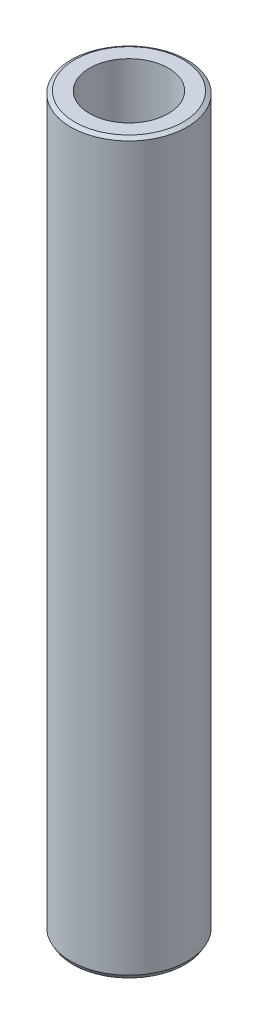
ISO-10303-21;
HEADER;
FILE_DESCRIPTION(('STEP AP214'),'2;1');
FILE_NAME('part.step','',(''),(''),'','','');
FILE_SCHEMA(('AUTOMOTIVE_DESIGN { 1 0 10303 214 1 1 1 1 }'));
ENDSEC;
DATA;
#1=APPLICATION_CONTEXT('core data for automotive mechanical design processes');
#2=APPLICATION_PROTOCOL_DEFINITION('international standard','automotive_design',2000,#1);
#3=PRODUCT_CONTEXT('',#1,'mechanical');
#4=PRODUCT('Part','Part','',(#3));
#5=PRODUCT_RELATED_PRODUCT_CATEGORY('part','',(#4));
#6=PRODUCT_DEFINITION_FORMATION('','',#4);
#7=PRODUCT_DEFINITION_CONTEXT('part definition',#1,'design');
#8=PRODUCT_DEFINITION('design','',#6,#7);
#9=PRODUCT_DEFINITION_SHAPE('','',#8);
#10=(LENGTH_UNIT() NAMED_UNIT(*) SI_UNIT(.MILLI.,.METRE.));
#11=(NAMED_UNIT(*) PLANE_ANGLE_UNIT() SI_UNIT($,.RADIAN.));
#12=(NAMED_UNIT(*) SI_UNIT($,.STERADIAN.) SOLID_ANGLE_UNIT());
#13=UNCERTAINTY_MEASURE_WITH_UNIT(LENGTH_MEASURE(1.E-05),#10,'distance_accuracy_value','');
#14=(GEOMETRIC_REPRESENTATION_CONTEXT(3) GLOBAL_UNCERTAINTY_ASSIGNED_CONTEXT((#13)) GLOBAL_UNIT_ASSIGNED_CONTEXT((#10,
#11,#12)) REPRESENTATION_CONTEXT('',''));
#15=CARTESIAN_POINT('',(0.,0.,0.));
#16=DIRECTION('',(0.,0.,1.));
#17=DIRECTION('',(1.,0.,0.));
#18=AXIS2_PLACEMENT_3D('',#15,#16,#17);
#19=CARTESIAN_POINT('',(0.,594.97015359687,0.));
#20=DIRECTION('',(0.,-1.,0.));
#21=DIRECTION('',(0.,0.,-1.));
#22=AXIS2_PLACEMENT_3D('',#19,#20,#21);
#23=CYLINDRICAL_SURFACE('',#22,47.5);
#24=CARTESIAN_POINT('',(0.,593.075020348738,0.));
#25=DIRECTION('',(0.,1.,0.));
#26=DIRECTION('',(0.,0.,1.));
#27=AXIS2_PLACEMENT_3D('',#24,#25,#26);
#28=CIRCLE('',#27,47.5);
#29=CARTESIAN_POINT('',(0.,593.075020348738,47.5));
#30=VERTEX_POINT('',#29);
#31=EDGE_CURVE('E50',#30,#30,#28,.F.);
#32=ORIENTED_EDGE('',*,*,#31,.T.);
#33=EDGE_LOOP('',(#32));
#34=FACE_BOUND('',#33,.T.);
#35=CARTESIAN_POINT('',(0.,3.28246707287672,0.));
#36=DIRECTION('',(0.,1.,0.));
#37=DIRECTION('',(0.,0.,1.));
#38=AXIS2_PLACEMENT_3D('',#35,#36,#37);
#39=CIRCLE('',#38,47.5);
#40=CARTESIAN_POINT('',(0.,3.28246707287672,47.5));
#41=VERTEX_POINT('',#40);
#42=EDGE_CURVE('E51',#41,#41,#39,.T.);
#43=ORIENTED_EDGE('',*,*,#42,.T.);
#44=EDGE_LOOP('',(#43));
#45=FACE_BOUND('',#44,.T.);
#46=ADVANCED_FACE('F39',(#34,#45),#23,.T.);
#47=CARTESIAN_POINT('',(0.,594.97015359687,0.));
#48=DIRECTION('',(0.,1.,0.));
#49=DIRECTION('',(0.,0.,1.));
#50=AXIS2_PLACEMENT_3D('',#47,#48,#49);
#51=PLANE('',#50);
#52=CARTESIAN_POINT('',(0.,594.97015359687,0.));
#53=DIRECTION('',(0.,1.,0.));
#54=DIRECTION('',(0.,0.,1.));
#55=AXIS2_PLACEMENT_3D('',#52,#53,#54);
#56=CIRCLE('',#55,44.2175329271232);
#57=CARTESIAN_POINT('',(0.,594.97015359687,44.2175329271232));
#58=VERTEX_POINT('',#57);
#59=EDGE_CURVE('E54',#58,#58,#56,.T.);
#60=ORIENTED_EDGE('',*,*,#59,.T.);
#61=EDGE_LOOP('',(#60));
#62=FACE_BOUND('',#61,.T.);
#63=CARTESIAN_POINT('',(0.,594.97015359687,0.));
#64=DIRECTION('',(0.,1.,0.));
#65=DIRECTION('',(0.,0.,1.));
#66=AXIS2_PLACEMENT_3D('',#63,#64,#65);
#67=CIRCLE('',#66,32.1678163694802);
#68=CARTESIAN_POINT('',(0.,594.97015359687,32.1678163694802));
#69=VERTEX_POINT('',#68);
#70=EDGE_CURVE('E58',#69,#69,#67,.T.);
#71=ORIENTED_EDGE('',*,*,#70,.F.);
#72=EDGE_LOOP('',(#71));
#73=FACE_BOUND('',#72,.T.);
#74=ADVANCED_FACE('F69',(#62,#73),#51,.T.);
#75=CARTESIAN_POINT('',(0.,0.,0.));
#76=DIRECTION('',(0.,1.,0.));
#77=DIRECTION('',(0.,0.,1.));
#78=AXIS2_PLACEMENT_3D('',#75,#76,#77);
#79=PLANE('',#78);
#80=CARTESIAN_POINT('',(0.,0.,0.));
#81=DIRECTION('',(0.,1.,0.));
#82=DIRECTION('',(0.,0.,1.));
#83=AXIS2_PLACEMENT_3D('',#80,#81,#82);
#84=CIRCLE('',#83,45.6048667518685);
#85=CARTESIAN_POINT('',(0.,0.,45.6048667518685));
#86=VERTEX_POINT('',#85);
#87=EDGE_CURVE('E10',#86,#86,#84,.F.);
#88=ORIENTED_EDGE('',*,*,#87,.T.);
#89=EDGE_LOOP('',(#88));
#90=FACE_BOUND('',#89,.T.);
#91=CARTESIAN_POINT('',(0.,0.,0.));
#92=DIRECTION('',(0.,1.,0.));
#93=DIRECTION('',(0.,0.,1.));
#94=AXIS2_PLACEMENT_3D('',#91,#92,#93);
#95=CIRCLE('',#94,32.1678163694802);
#96=CARTESIAN_POINT('',(0.,0.,32.1678163694802));
#97=VERTEX_POINT('',#96);
#98=EDGE_CURVE('E63',#97,#97,#95,.T.);
#99=ORIENTED_EDGE('',*,*,#98,.T.);
#100=EDGE_LOOP('',(#99));
#101=FACE_BOUND('',#100,.T.);
#102=ADVANCED_FACE('F75',(#90,#101),#79,.F.);
#103=CARTESIAN_POINT('',(0.,594.97015359687,0.));
#104=DIRECTION('',(0.,-1.,0.));
#105=DIRECTION('',(0.,0.,-1.));
#106=AXIS2_PLACEMENT_3D('',#103,#104,#105);
#107=CYLINDRICAL_SURFACE('',#106,32.1678163694802);
#108=ORIENTED_EDGE('',*,*,#70,.T.);
#109=EDGE_LOOP('',(#108));
#110=FACE_BOUND('',#109,.T.);
#111=ORIENTED_EDGE('',*,*,#98,.F.);
#112=EDGE_LOOP('',(#111));
#113=FACE_BOUND('',#112,.T.);
#114=ADVANCED_FACE('F70',(#110,#113),#107,.F.);
#115=CARTESIAN_POINT('',(0.,594.97015359687,0.));
#116=DIRECTION('',(0.,-1.,0.));
#117=DIRECTION('',(0.,0.,-1.));
#118=AXIS2_PLACEMENT_3D('',#115,#116,#117);
#119=CONICAL_SURFACE('',#118,44.2175329271232,1.0471975511966);
#120=ORIENTED_EDGE('',*,*,#31,.F.);
#121=EDGE_LOOP('',(#120));
#122=FACE_BOUND('',#121,.T.);
#123=ORIENTED_EDGE('',*,*,#59,.F.);
#124=EDGE_LOOP('',(#123));
#125=FACE_BOUND('',#124,.T.);
#126=ADVANCED_FACE('F81',(#122,#125),#119,.T.);
#127=CARTESIAN_POINT('',(0.,3.28246707287672,0.));
#128=DIRECTION('',(0.,1.,0.));
#129=DIRECTION('',(0.,0.,1.));
#130=AXIS2_PLACEMENT_3D('',#127,#128,#129);
#131=CONICAL_SURFACE('',#130,47.5,0.523598775598316);
#132=ORIENTED_EDGE('',*,*,#87,.F.);
#133=EDGE_LOOP('',(#132));
#134=FACE_BOUND('',#133,.T.);
#135=ORIENTED_EDGE('',*,*,#42,.F.);
#136=EDGE_LOOP('',(#135));
#137=FACE_BOUND('',#136,.T.);
#138=ADVANCED_FACE('F45',(#134,#137),#131,.T.);
#139=CLOSED_SHELL('',(#46,#74,#102,#114,#126,#138));
#140=MANIFOLD_SOLID_BREP('B2',#139);
#141=ADVANCED_BREP_SHAPE_REPRESENTATION('',(#18,#140),#14);
#142=SHAPE_DEFINITION_REPRESENTATION(#9,#141);
ENDSEC;
END-ISO-10303-21;
